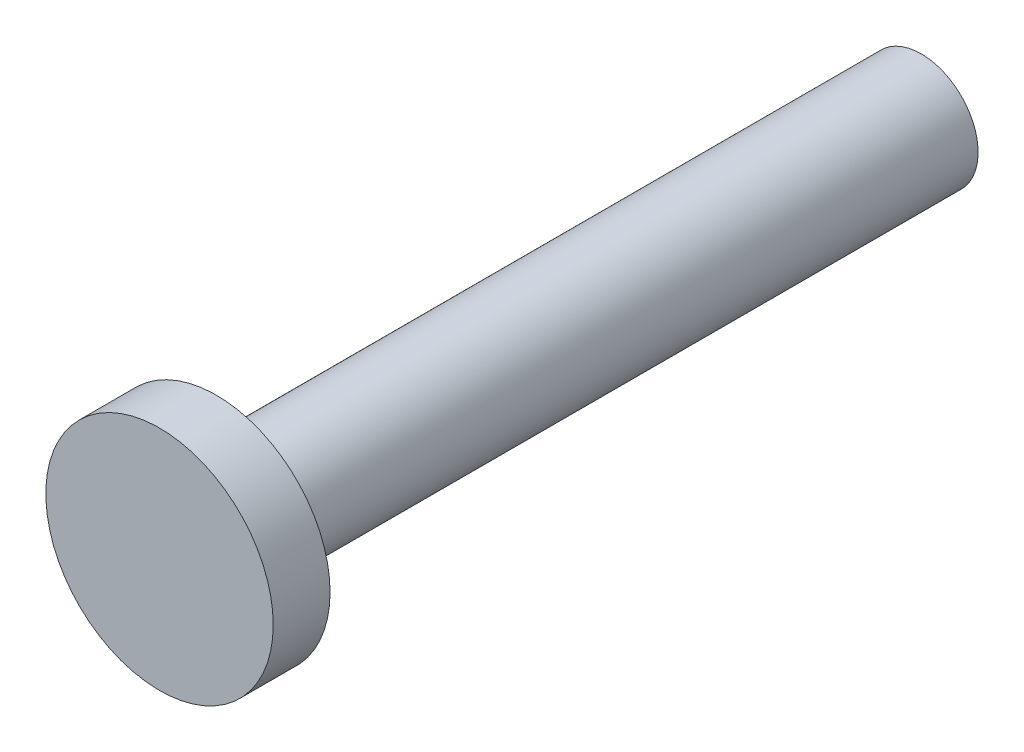
ISO-10303-21;
HEADER;
FILE_DESCRIPTION(('STEP AP214'),'2;1');
FILE_NAME('part.step','',(''),(''),'','','');
FILE_SCHEMA(('AUTOMOTIVE_DESIGN { 1 0 10303 214 1 1 1 1 }'));
ENDSEC;
DATA;
#1=APPLICATION_CONTEXT('core data for automotive mechanical design processes');
#2=APPLICATION_PROTOCOL_DEFINITION('international standard','automotive_design',2000,#1);
#3=PRODUCT_CONTEXT('',#1,'mechanical');
#4=PRODUCT('Part','Part','',(#3));
#5=PRODUCT_RELATED_PRODUCT_CATEGORY('part','',(#4));
#6=PRODUCT_DEFINITION_FORMATION('','',#4);
#7=PRODUCT_DEFINITION_CONTEXT('part definition',#1,'design');
#8=PRODUCT_DEFINITION('design','',#6,#7);
#9=PRODUCT_DEFINITION_SHAPE('','',#8);
#10=(LENGTH_UNIT() NAMED_UNIT(*) SI_UNIT(.MILLI.,.METRE.));
#11=(NAMED_UNIT(*) PLANE_ANGLE_UNIT() SI_UNIT($,.RADIAN.));
#12=(NAMED_UNIT(*) SI_UNIT($,.STERADIAN.) SOLID_ANGLE_UNIT());
#13=UNCERTAINTY_MEASURE_WITH_UNIT(LENGTH_MEASURE(1.E-05),#10,'distance_accuracy_value','');
#14=(GEOMETRIC_REPRESENTATION_CONTEXT(3) GLOBAL_UNCERTAINTY_ASSIGNED_CONTEXT((#13)) GLOBAL_UNIT_ASSIGNED_CONTEXT((#10,
#11,#12)) REPRESENTATION_CONTEXT('',''));
#15=CARTESIAN_POINT('',(0.,0.,0.));
#16=DIRECTION('',(0.,0.,1.));
#17=DIRECTION('',(1.,0.,0.));
#18=AXIS2_PLACEMENT_3D('',#15,#16,#17);
#19=CARTESIAN_POINT('',(0.,0.,1.27));
#20=DIRECTION('',(0.,0.,-1.));
#21=DIRECTION('',(-1.,0.,0.));
#22=AXIS2_PLACEMENT_3D('',#19,#20,#21);
#23=CYLINDRICAL_SURFACE('',#22,2.54);
#24=CARTESIAN_POINT('',(0.,0.,1.27));
#25=DIRECTION('',(0.,0.,1.));
#26=DIRECTION('',(1.,0.,0.));
#27=AXIS2_PLACEMENT_3D('',#24,#25,#26);
#28=CIRCLE('',#27,2.54);
#29=CARTESIAN_POINT('',(2.54,0.,1.27));
#30=VERTEX_POINT('',#29);
#31=EDGE_CURVE('E45',#30,#30,#28,.T.);
#32=ORIENTED_EDGE('',*,*,#31,.F.);
#33=EDGE_LOOP('',(#32));
#34=FACE_BOUND('',#33,.T.);
#35=CARTESIAN_POINT('',(0.,0.,0.));
#36=DIRECTION('',(0.,0.,1.));
#37=DIRECTION('',(1.,0.,0.));
#38=AXIS2_PLACEMENT_3D('',#35,#36,#37);
#39=CIRCLE('',#38,2.54);
#40=CARTESIAN_POINT('',(2.54,0.,0.));
#41=VERTEX_POINT('',#40);
#42=EDGE_CURVE('E40',#41,#41,#39,.T.);
#43=ORIENTED_EDGE('',*,*,#42,.T.);
#44=EDGE_LOOP('',(#43));
#45=FACE_BOUND('',#44,.T.);
#46=ADVANCED_FACE('F37',(#34,#45),#23,.T.);
#47=CARTESIAN_POINT('',(0.,0.,1.27));
#48=DIRECTION('',(0.,0.,1.));
#49=DIRECTION('',(1.,0.,0.));
#50=AXIS2_PLACEMENT_3D('',#47,#48,#49);
#51=PLANE('',#50);
#52=ORIENTED_EDGE('',*,*,#31,.T.);
#53=EDGE_LOOP('',(#52));
#54=FACE_BOUND('',#53,.T.);
#55=ADVANCED_FACE('F65',(#54),#51,.T.);
#56=CARTESIAN_POINT('',(0.,0.,0.));
#57=DIRECTION('',(0.,0.,1.));
#58=DIRECTION('',(1.,0.,0.));
#59=AXIS2_PLACEMENT_3D('',#56,#57,#58);
#60=PLANE('',#59);
#61=CARTESIAN_POINT('',(0.,0.,0.));
#62=DIRECTION('',(0.,0.,-1.));
#63=DIRECTION('',(-1.,0.,0.));
#64=AXIS2_PLACEMENT_3D('',#61,#62,#63);
#65=CIRCLE('',#64,1.27);
#66=CARTESIAN_POINT('',(-1.27,0.,0.));
#67=VERTEX_POINT('',#66);
#68=EDGE_CURVE('E10',#67,#67,#65,.T.);
#69=ORIENTED_EDGE('',*,*,#68,.F.);
#70=EDGE_LOOP('',(#69));
#71=FACE_BOUND('',#70,.T.);
#72=ORIENTED_EDGE('',*,*,#42,.F.);
#73=EDGE_LOOP('',(#72));
#74=FACE_BOUND('',#73,.T.);
#75=ADVANCED_FACE('F62',(#71,#74),#60,.F.);
#76=CARTESIAN_POINT('',(0.,0.,-15.748));
#77=DIRECTION('',(0.,0.,1.));
#78=DIRECTION('',(1.,0.,0.));
#79=AXIS2_PLACEMENT_3D('',#76,#77,#78);
#80=CYLINDRICAL_SURFACE('',#79,1.27);
#81=CARTESIAN_POINT('',(0.,0.,-15.748));
#82=DIRECTION('',(0.,0.,-1.));
#83=DIRECTION('',(-1.,0.,0.));
#84=AXIS2_PLACEMENT_3D('',#81,#82,#83);
#85=CIRCLE('',#84,1.27);
#86=CARTESIAN_POINT('',(-1.27,0.,-15.748));
#87=VERTEX_POINT('',#86);
#88=EDGE_CURVE('E52',#87,#87,#85,.T.);
#89=ORIENTED_EDGE('',*,*,#88,.F.);
#90=EDGE_LOOP('',(#89));
#91=FACE_BOUND('',#90,.T.);
#92=ORIENTED_EDGE('',*,*,#68,.T.);
#93=EDGE_LOOP('',(#92));
#94=FACE_BOUND('',#93,.T.);
#95=ADVANCED_FACE('F64',(#91,#94),#80,.T.);
#96=CARTESIAN_POINT('',(0.,0.,-15.748));
#97=DIRECTION('',(0.,0.,-1.));
#98=DIRECTION('',(-1.,0.,0.));
#99=AXIS2_PLACEMENT_3D('',#96,#97,#98);
#100=PLANE('',#99);
#101=ORIENTED_EDGE('',*,*,#88,.T.);
#102=EDGE_LOOP('',(#101));
#103=FACE_BOUND('',#102,.T.);
#104=ADVANCED_FACE('F71',(#103),#100,.T.);
#105=CLOSED_SHELL('',(#46,#55,#75,#95,#104));
#106=MANIFOLD_SOLID_BREP('B2',#105);
#107=ADVANCED_BREP_SHAPE_REPRESENTATION('',(#18,#106),#14);
#108=SHAPE_DEFINITION_REPRESENTATION(#9,#107);
ENDSEC;
END-ISO-10303-21;
